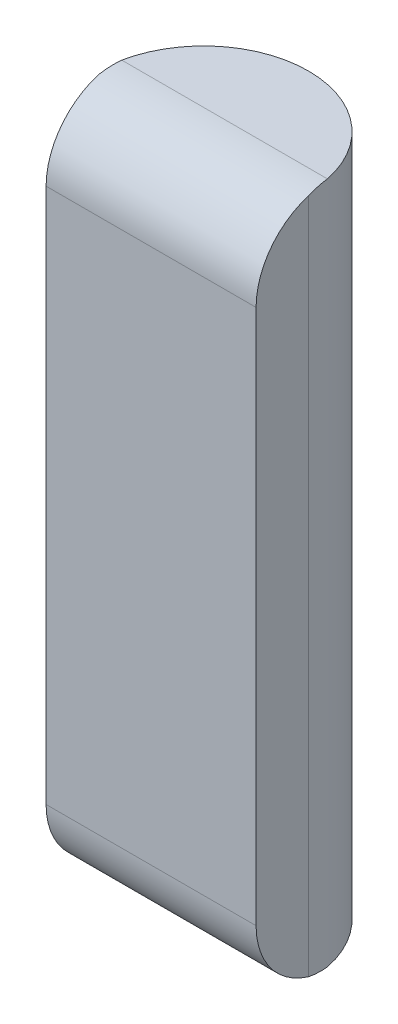
ISO-10303-21;
HEADER;
FILE_DESCRIPTION(('STEP AP214'),'2;1');
FILE_NAME('part.step','',(''),(''),'','','');
FILE_SCHEMA(('AUTOMOTIVE_DESIGN { 1 0 10303 214 1 1 1 1 }'));
ENDSEC;
DATA;
#1=APPLICATION_CONTEXT('core data for automotive mechanical design processes');
#2=APPLICATION_PROTOCOL_DEFINITION('international standard','automotive_design',2000,#1);
#3=PRODUCT_CONTEXT('',#1,'mechanical');
#4=PRODUCT('Part','Part','',(#3));
#5=PRODUCT_RELATED_PRODUCT_CATEGORY('part','',(#4));
#6=PRODUCT_DEFINITION_FORMATION('','',#4);
#7=PRODUCT_DEFINITION_CONTEXT('part definition',#1,'design');
#8=PRODUCT_DEFINITION('design','',#6,#7);
#9=PRODUCT_DEFINITION_SHAPE('','',#8);
#10=(LENGTH_UNIT() NAMED_UNIT(*) SI_UNIT(.MILLI.,.METRE.));
#11=(NAMED_UNIT(*) PLANE_ANGLE_UNIT() SI_UNIT($,.RADIAN.));
#12=(NAMED_UNIT(*) SI_UNIT($,.STERADIAN.) SOLID_ANGLE_UNIT());
#13=UNCERTAINTY_MEASURE_WITH_UNIT(LENGTH_MEASURE(1.E-05),#10,'distance_accuracy_value','');
#14=(GEOMETRIC_REPRESENTATION_CONTEXT(3) GLOBAL_UNCERTAINTY_ASSIGNED_CONTEXT((#13)) GLOBAL_UNIT_ASSIGNED_CONTEXT((#10,
#11,#12)) REPRESENTATION_CONTEXT('',''));
#15=CARTESIAN_POINT('',(0.,0.,0.));
#16=DIRECTION('',(0.,0.,1.));
#17=DIRECTION('',(1.,0.,0.));
#18=AXIS2_PLACEMENT_3D('',#15,#16,#17);
#19=CARTESIAN_POINT('',(-0.6,0.,0.35));
#20=DIRECTION('',(0.,1.,0.));
#21=DIRECTION('',(0.,0.,-1.));
#22=AXIS2_PLACEMENT_3D('',#19,#20,#21);
#23=CYLINDRICAL_SURFACE('',#22,0.1);
#24=CARTESIAN_POINT('',(-0.499999999999999,0.647082039324995,0.349999999999997));
#25=CARTESIAN_POINT('',(-0.500084183762027,0.647323506050398,0.349190121189793));
#26=CARTESIAN_POINT('',(-0.500168367524055,0.647550292569989,0.348375866058584));
#27=CARTESIAN_POINT('',(-0.500336735048111,0.647974238368766,0.34673967912913));
#28=CARTESIAN_POINT('',(-0.500420918810139,0.648171397647952,0.345917747330885));
#29=CARTESIAN_POINT('',(-0.500589286334195,0.648535822137135,0.344267283042332));
#30=CARTESIAN_POINT('',(-0.500673470096223,0.648703087347132,0.343438750552023));
#31=CARTESIAN_POINT('',(-0.500841837620279,0.649007506544538,0.341776172212152));
#32=CARTESIAN_POINT('',(-0.500926021382307,0.649144660531946,0.340942126362589));
#33=CARTESIAN_POINT('',(-0.501094388906364,0.649388676630988,0.339269615138349));
#34=CARTESIAN_POINT('',(-0.501178572668392,0.649495538742622,0.338431149763672));
#35=CARTESIAN_POINT('',(-0.501346940192448,0.649678831688704,0.336750899341898));
#36=CARTESIAN_POINT('',(-0.501431123954476,0.649755262523153,0.3359091142948));
#37=CARTESIAN_POINT('',(-0.501599491478532,0.649877590349677,0.334223328579187));
#38=CARTESIAN_POINT('',(-0.50168367524056,0.649923487341753,0.333379327910672));
#39=CARTESIAN_POINT('',(-0.501852042764616,0.649984695768093,0.331690218311812));
#40=CARTESIAN_POINT('',(-0.501936226526644,0.650000007202358,0.330845109381467));
#41=CARTESIAN_POINT('',(-0.502020410288672,0.65,0.33));
#42=B_SPLINE_CURVE_WITH_KNOTS('',3,(#24,#25,#26,#27,#28,#29,#30,#31,#32,#33,#34,#35,#36,#37,#38,
#39,#40,#41),.UNSPECIFIED.,.F.,.F.,(4,2,2,2,2,2,2,2,4),(0.,0.0025477371259426,
0.00509547425188515,0.00764321137782775,0.0101909485037703,0.0127386856297129,
0.0152864227556555,0.0178341598815981,0.0203818970075407),.UNSPECIFIED.);
#43=CARTESIAN_POINT('',(-0.499999999999999,0.647082039324994,0.35));
#44=VERTEX_POINT('',#43);
#45=CARTESIAN_POINT('',(-0.502020410288672,0.65,0.33));
#46=VERTEX_POINT('',#45);
#47=EDGE_CURVE('E11',#44,#46,#42,.T.);
#48=ORIENTED_EDGE('',*,*,#47,.F.);
#49=DIRECTION('',(0.,1.,0.));
#50=VECTOR('',#49,1.);
#51=CARTESIAN_POINT('',(-0.499999999999999,0.,0.35));
#52=LINE('',#51,#50);
#53=CARTESIAN_POINT('',(-0.499999999999999,0.00291796067500615,0.35));
#54=VERTEX_POINT('',#53);
#55=EDGE_CURVE('E25',#54,#44,#52,.T.);
#56=ORIENTED_EDGE('',*,*,#55,.F.);
#57=CARTESIAN_POINT('',(-0.5020204102887,0.,0.33));
#58=CARTESIAN_POINT('',(-0.501936226526671,-7.20235842162594E-09,0.330845109381467));
#59=CARTESIAN_POINT('',(-0.501852042764642,1.53042319068136E-05,0.331690218311812));
#60=CARTESIAN_POINT('',(-0.501683675240583,7.65126582475006E-05,0.333379327910672));
#61=CARTESIAN_POINT('',(-0.501599491478554,0.000122409650322954,0.334223328579187));
#62=CARTESIAN_POINT('',(-0.501431123954496,0.000244737476846978,0.3359091142948));
#63=CARTESIAN_POINT('',(-0.501346940192467,0.000321168311295546,0.336750899341898));
#64=CARTESIAN_POINT('',(-0.501178572668408,0.000504461257377994,0.338431149763672));
#65=CARTESIAN_POINT('',(-0.501094388906379,0.000611323369011874,0.339269615138349));
#66=CARTESIAN_POINT('',(-0.500926021382321,0.000855339468053757,0.340942126362589));
#67=CARTESIAN_POINT('',(-0.500841837620292,0.00099249345546176,0.341776172212152));
#68=CARTESIAN_POINT('',(-0.500673470096233,0.00129691265286739,0.343438750552023));
#69=CARTESIAN_POINT('',(-0.500589286334204,0.00146417786286501,0.344267283042332));
#70=CARTESIAN_POINT('',(-0.500420918810146,0.00182860235204825,0.345917747330885));
#71=CARTESIAN_POINT('',(-0.500336735048117,0.00202576163123386,0.34673967912913));
#72=CARTESIAN_POINT('',(-0.500168367524058,0.00244970743001084,0.348375866058584));
#73=CARTESIAN_POINT('',(-0.500084183762029,0.00267649394960222,0.349190121189793));
#74=CARTESIAN_POINT('',(-0.5,0.00291796067500535,0.349999999999997));
#75=B_SPLINE_CURVE_WITH_KNOTS('',3,(#57,#58,#59,#60,#61,#62,#63,#64,#65,#66,#67,#68,#69,#70,#71,
#72,#73,#74),.UNSPECIFIED.,.F.,.F.,(4,2,2,2,2,2,2,2,4),(0.,0.00254773712594288,
0.00509547425188592,0.00764321137782881,0.0101909485037717,0.0127386856297146,
0.0152864227556576,0.0178341598816005,0.0203818970075435),.UNSPECIFIED.);
#76=CARTESIAN_POINT('',(-0.502020410288672,0.,0.33));
#77=VERTEX_POINT('',#76);
#78=EDGE_CURVE('E171',#77,#54,#75,.T.);
#79=ORIENTED_EDGE('',*,*,#78,.F.);
#80=CARTESIAN_POINT('',(-0.6,0.,0.35));
#81=DIRECTION('',(0.,1.,0.));
#82=DIRECTION('',(0.,0.,1.));
#83=AXIS2_PLACEMENT_3D('',#80,#81,#82);
#84=CIRCLE('',#83,0.1);
#85=CARTESIAN_POINT('',(-0.697979589711327,0.,0.33));
#86=VERTEX_POINT('',#85);
#87=EDGE_CURVE('E206',#77,#86,#84,.T.);
#88=ORIENTED_EDGE('',*,*,#87,.T.);
#89=CARTESIAN_POINT('',(-0.7,0.00291796067500534,0.349999999999997));
#90=CARTESIAN_POINT('',(-0.699915816237971,0.00267649394960219,0.349190121189793));
#91=CARTESIAN_POINT('',(-0.699831632475942,0.00244970743001082,0.348375866058584));
#92=CARTESIAN_POINT('',(-0.699663264951883,0.00202576163123384,0.34673967912913));
#93=CARTESIAN_POINT('',(-0.699579081189854,0.00182860235204824,0.345917747330885));
#94=CARTESIAN_POINT('',(-0.699410713665796,0.00146417786286501,0.344267283042332));
#95=CARTESIAN_POINT('',(-0.699326529903767,0.00129691265286739,0.343438750552023));
#96=CARTESIAN_POINT('',(-0.699158162379708,0.000992493455461746,0.341776172212152));
#97=CARTESIAN_POINT('',(-0.699073978617679,0.00085533946805373,0.340942126362589));
#98=CARTESIAN_POINT('',(-0.698905611093621,0.000611323369011853,0.339269615138349));
#99=CARTESIAN_POINT('',(-0.698821427331592,0.000504461257377991,0.338431149763672));
#100=CARTESIAN_POINT('',(-0.698653059807533,0.000321168311295548,0.336750899341898));
#101=CARTESIAN_POINT('',(-0.698568876045504,0.000244737476846967,0.3359091142948));
#102=CARTESIAN_POINT('',(-0.698400508521446,0.000122409650322941,0.334223328579187));
#103=CARTESIAN_POINT('',(-0.698316324759417,7.65126582474951E-05,0.333379327910672));
#104=CARTESIAN_POINT('',(-0.698147957235358,1.53042319068173E-05,0.331690218311812));
#105=CARTESIAN_POINT('',(-0.698063773473329,-7.20235841463584E-09,0.330845109381467));
#106=CARTESIAN_POINT('',(-0.6979795897113,0.,0.33));
#107=B_SPLINE_CURVE_WITH_KNOTS('',3,(#89,#90,#91,#92,#93,#94,#95,#96,#97,#98,#99,#100,#101,#102,
#103,#104,#105,#106),.UNSPECIFIED.,.F.,.F.,(4,2,2,2,2,2,2,2,4),(0.,0.00254773712594293,
0.00509547425188588,0.00764321137782877,0.0101909485037718,0.0127386856297147,
0.0152864227556576,0.0178341598816006,0.0203818970075435),.UNSPECIFIED.);
#108=CARTESIAN_POINT('',(-0.7,0.00291796067500618,0.35));
#109=VERTEX_POINT('',#108);
#110=EDGE_CURVE('E203',#109,#86,#107,.T.);
#111=ORIENTED_EDGE('',*,*,#110,.F.);
#112=DIRECTION('',(0.,1.,0.));
#113=VECTOR('',#112,1.);
#114=CARTESIAN_POINT('',(-0.7,0.,0.35));
#115=LINE('',#114,#113);
#116=CARTESIAN_POINT('',(-0.7,0.647082039324994,0.35));
#117=VERTEX_POINT('',#116);
#118=EDGE_CURVE('E75',#109,#117,#115,.T.);
#119=ORIENTED_EDGE('',*,*,#118,.T.);
#120=CARTESIAN_POINT('',(-0.697979589711327,0.65,0.33));
#121=CARTESIAN_POINT('',(-0.698063773473355,0.650000007202358,0.330845109381467));
#122=CARTESIAN_POINT('',(-0.698147957235383,0.649984695768093,0.331690218311812));
#123=CARTESIAN_POINT('',(-0.698316324759439,0.649923487341753,0.333379327910672));
#124=CARTESIAN_POINT('',(-0.698400508521467,0.649877590349677,0.334223328579187));
#125=CARTESIAN_POINT('',(-0.698568876045523,0.649755262523153,0.3359091142948));
#126=CARTESIAN_POINT('',(-0.698653059807551,0.649678831688704,0.336750899341897));
#127=CARTESIAN_POINT('',(-0.698821427331607,0.649495538742622,0.338431149763672));
#128=CARTESIAN_POINT('',(-0.698905611093635,0.649388676630988,0.339269615138349));
#129=CARTESIAN_POINT('',(-0.699073978617692,0.649144660531946,0.340942126362589));
#130=CARTESIAN_POINT('',(-0.69915816237972,0.649007506544538,0.341776172212152));
#131=CARTESIAN_POINT('',(-0.699326529903776,0.648703087347133,0.343438750552023));
#132=CARTESIAN_POINT('',(-0.699410713665804,0.648535822137135,0.344267283042332));
#133=CARTESIAN_POINT('',(-0.69957908118986,0.648171397647952,0.345917747330885));
#134=CARTESIAN_POINT('',(-0.699663264951888,0.647974238368766,0.34673967912913));
#135=CARTESIAN_POINT('',(-0.699831632475944,0.647550292569989,0.348375866058584));
#136=CARTESIAN_POINT('',(-0.699915816237972,0.647323506050398,0.349190121189793));
#137=CARTESIAN_POINT('',(-0.7,0.647082039324995,0.349999999999997));
#138=B_SPLINE_CURVE_WITH_KNOTS('',3,(#120,#121,#122,#123,#124,#125,#126,#127,#128,#129,#130,
#131,#132,#133,#134,#135,#136,#137),.UNSPECIFIED.,.F.,.F.,(4,2,2,2,2,2,2,2,4),(0.,
0.00254773712594256,0.00509547425188514,0.00764321137782775,0.0101909485037703,
0.0127386856297129,0.0152864227556554,0.0178341598815981,0.0203818970075407),.UNSPECIFIED.);
#139=CARTESIAN_POINT('',(-0.697979589711327,0.65,0.33));
#140=VERTEX_POINT('',#139);
#141=EDGE_CURVE('E125',#140,#117,#138,.T.);
#142=ORIENTED_EDGE('',*,*,#141,.F.);
#143=CARTESIAN_POINT('',(-0.6,0.65,0.35));
#144=DIRECTION('',(0.,1.,0.));
#145=DIRECTION('',(0.,0.,1.));
#146=AXIS2_PLACEMENT_3D('',#143,#144,#145);
#147=CIRCLE('',#146,0.1);
#148=EDGE_CURVE('E120',#46,#140,#147,.T.);
#149=ORIENTED_EDGE('',*,*,#148,.F.);
#150=EDGE_LOOP('',(#48,#56,#79,#88,#111,#119,#142,#149));
#151=FACE_BOUND('',#150,.T.);
#152=ADVANCED_FACE('F17',(#151),#23,.T.);
#153=CARTESIAN_POINT('',(-0.499999999999999,0.,0.35));
#154=DIRECTION('',(1.,0.,0.));
#155=DIRECTION('',(0.,0.,-1.));
#156=AXIS2_PLACEMENT_3D('',#153,#154,#155);
#157=PLANE('',#156);
#158=CARTESIAN_POINT('',(-0.499999999999999,0.58,0.33));
#159=DIRECTION('',(-1.,0.,0.));
#160=DIRECTION('',(0.,0.,-1.));
#161=AXIS2_PLACEMENT_3D('',#158,#159,#160);
#162=CIRCLE('',#161,0.07);
#163=CARTESIAN_POINT('',(-0.499999999999999,0.58,0.4));
#164=VERTEX_POINT('',#163);
#165=EDGE_CURVE('E116',#164,#44,#162,.T.);
#166=ORIENTED_EDGE('',*,*,#165,.F.);
#167=DIRECTION('',(0.,-1.,0.));
#168=VECTOR('',#167,1.);
#169=CARTESIAN_POINT('',(-0.499999999999999,0.65,0.4));
#170=LINE('',#169,#168);
#171=CARTESIAN_POINT('',(-0.499999999999999,0.07,0.4));
#172=VERTEX_POINT('',#171);
#173=EDGE_CURVE('E114',#164,#172,#170,.T.);
#174=ORIENTED_EDGE('',*,*,#173,.T.);
#175=CARTESIAN_POINT('',(-0.499999999999999,0.07,0.33));
#176=DIRECTION('',(-1.,0.,0.));
#177=DIRECTION('',(0.,0.,-1.));
#178=AXIS2_PLACEMENT_3D('',#175,#176,#177);
#179=CIRCLE('',#178,0.07);
#180=EDGE_CURVE('E94',#54,#172,#179,.T.);
#181=ORIENTED_EDGE('',*,*,#180,.F.);
#182=ORIENTED_EDGE('',*,*,#55,.T.);
#183=EDGE_LOOP('',(#166,#174,#181,#182));
#184=FACE_BOUND('',#183,.T.);
#185=ADVANCED_FACE('F226',(#184),#157,.T.);
#186=CARTESIAN_POINT('',(-0.7,0.,0.4));
#187=DIRECTION('',(-1.,0.,0.));
#188=DIRECTION('',(0.,0.,1.));
#189=AXIS2_PLACEMENT_3D('',#186,#187,#188);
#190=PLANE('',#189);
#191=CARTESIAN_POINT('',(-0.7,0.58,0.33));
#192=DIRECTION('',(1.,0.,0.));
#193=DIRECTION('',(0.,0.,1.));
#194=AXIS2_PLACEMENT_3D('',#191,#192,#193);
#195=CIRCLE('',#194,0.07);
#196=CARTESIAN_POINT('',(-0.7,0.58,0.4));
#197=VERTEX_POINT('',#196);
#198=EDGE_CURVE('E79',#117,#197,#195,.T.);
#199=ORIENTED_EDGE('',*,*,#198,.F.);
#200=ORIENTED_EDGE('',*,*,#118,.F.);
#201=CARTESIAN_POINT('',(-0.7,0.07,0.33));
#202=DIRECTION('',(1.,0.,0.));
#203=DIRECTION('',(0.,0.,1.));
#204=AXIS2_PLACEMENT_3D('',#201,#202,#203);
#205=CIRCLE('',#204,0.07);
#206=CARTESIAN_POINT('',(-0.7,0.07,0.4));
#207=VERTEX_POINT('',#206);
#208=EDGE_CURVE('E69',#207,#109,#205,.T.);
#209=ORIENTED_EDGE('',*,*,#208,.F.);
#210=DIRECTION('',(0.,1.,0.));
#211=VECTOR('',#210,1.);
#212=CARTESIAN_POINT('',(-0.7,0.,0.4));
#213=LINE('',#212,#211);
#214=EDGE_CURVE('E73',#207,#197,#213,.T.);
#215=ORIENTED_EDGE('',*,*,#214,.T.);
#216=EDGE_LOOP('',(#199,#200,#209,#215));
#217=FACE_BOUND('',#216,.T.);
#218=ADVANCED_FACE('F72',(#217),#190,.T.);
#219=CARTESIAN_POINT('',(0.,0.58,0.33));
#220=DIRECTION('',(-1.,0.,0.));
#221=DIRECTION('',(0.,0.,1.));
#222=AXIS2_PLACEMENT_3D('',#219,#220,#221);
#223=CYLINDRICAL_SURFACE('',#222,0.07);
#224=DIRECTION('',(1.,0.,0.));
#225=VECTOR('',#224,1.);
#226=CARTESIAN_POINT('',(0.8,0.65,0.33));
#227=LINE('',#226,#225);
#228=EDGE_CURVE('E88',#140,#46,#227,.T.);
#229=ORIENTED_EDGE('',*,*,#228,.F.);
#230=ORIENTED_EDGE('',*,*,#141,.T.);
#231=ORIENTED_EDGE('',*,*,#198,.T.);
#232=DIRECTION('',(-1.,0.,0.));
#233=VECTOR('',#232,1.);
#234=CARTESIAN_POINT('',(-0.8,0.58,0.4));
#235=LINE('',#234,#233);
#236=EDGE_CURVE('E87',#164,#197,#235,.T.);
#237=ORIENTED_EDGE('',*,*,#236,.F.);
#238=ORIENTED_EDGE('',*,*,#165,.T.);
#239=ORIENTED_EDGE('',*,*,#47,.T.);
#240=EDGE_LOOP('',(#229,#230,#231,#237,#238,#239));
#241=FACE_BOUND('',#240,.T.);
#242=ADVANCED_FACE('F141',(#241),#223,.T.);
#243=CARTESIAN_POINT('',(0.,0.65,0.));
#244=DIRECTION('',(0.,1.,0.));
#245=DIRECTION('',(0.,0.,1.));
#246=AXIS2_PLACEMENT_3D('',#243,#244,#245);
#247=PLANE('',#246);
#248=ORIENTED_EDGE('',*,*,#228,.T.);
#249=ORIENTED_EDGE('',*,*,#148,.T.);
#250=EDGE_LOOP('',(#248,#249));
#251=FACE_BOUND('',#250,.T.);
#252=ADVANCED_FACE('F151',(#251),#247,.T.);
#253=CARTESIAN_POINT('',(0.8,0.65,0.4));
#254=DIRECTION('',(0.,0.,-1.));
#255=DIRECTION('',(-1.,0.,0.));
#256=AXIS2_PLACEMENT_3D('',#253,#254,#255);
#257=PLANE('',#256);
#258=ORIENTED_EDGE('',*,*,#214,.F.);
#259=DIRECTION('',(1.,0.,0.));
#260=VECTOR('',#259,1.);
#261=CARTESIAN_POINT('',(0.8,0.07,0.4));
#262=LINE('',#261,#260);
#263=EDGE_CURVE('E85',#207,#172,#262,.T.);
#264=ORIENTED_EDGE('',*,*,#263,.T.);
#265=ORIENTED_EDGE('',*,*,#173,.F.);
#266=ORIENTED_EDGE('',*,*,#236,.T.);
#267=EDGE_LOOP('',(#258,#264,#265,#266));
#268=FACE_BOUND('',#267,.T.);
#269=ADVANCED_FACE('F83',(#268),#257,.F.);
#270=CARTESIAN_POINT('',(0.8,0.07,0.33));
#271=DIRECTION('',(1.,0.,0.));
#272=DIRECTION('',(0.,0.,-1.));
#273=AXIS2_PLACEMENT_3D('',#270,#271,#272);
#274=CYLINDRICAL_SURFACE('',#273,0.07);
#275=ORIENTED_EDGE('',*,*,#208,.T.);
#276=ORIENTED_EDGE('',*,*,#110,.T.);
#277=DIRECTION('',(-1.,0.,0.));
#278=VECTOR('',#277,1.);
#279=CARTESIAN_POINT('',(0.,0.,0.33));
#280=LINE('',#279,#278);
#281=EDGE_CURVE('E95',#77,#86,#280,.T.);
#282=ORIENTED_EDGE('',*,*,#281,.F.);
#283=ORIENTED_EDGE('',*,*,#78,.T.);
#284=ORIENTED_EDGE('',*,*,#180,.T.);
#285=ORIENTED_EDGE('',*,*,#263,.F.);
#286=EDGE_LOOP('',(#275,#276,#282,#283,#284,#285));
#287=FACE_BOUND('',#286,.T.);
#288=ADVANCED_FACE('F91',(#287),#274,.T.);
#289=CARTESIAN_POINT('',(0.,0.,0.));
#290=DIRECTION('',(0.,1.,0.));
#291=DIRECTION('',(0.,0.,1.));
#292=AXIS2_PLACEMENT_3D('',#289,#290,#291);
#293=PLANE('',#292);
#294=ORIENTED_EDGE('',*,*,#87,.F.);
#295=ORIENTED_EDGE('',*,*,#281,.T.);
#296=EDGE_LOOP('',(#294,#295));
#297=FACE_BOUND('',#296,.T.);
#298=ADVANCED_FACE('F189',(#297),#293,.F.);
#299=CLOSED_SHELL('',(#152,#185,#218,#242,#252,#269,#288,#298));
#300=MANIFOLD_SOLID_BREP('B1',#299);
#301=ADVANCED_BREP_SHAPE_REPRESENTATION('',(#18,#300),#14);
#302=SHAPE_DEFINITION_REPRESENTATION(#9,#301);
ENDSEC;
END-ISO-10303-21;
